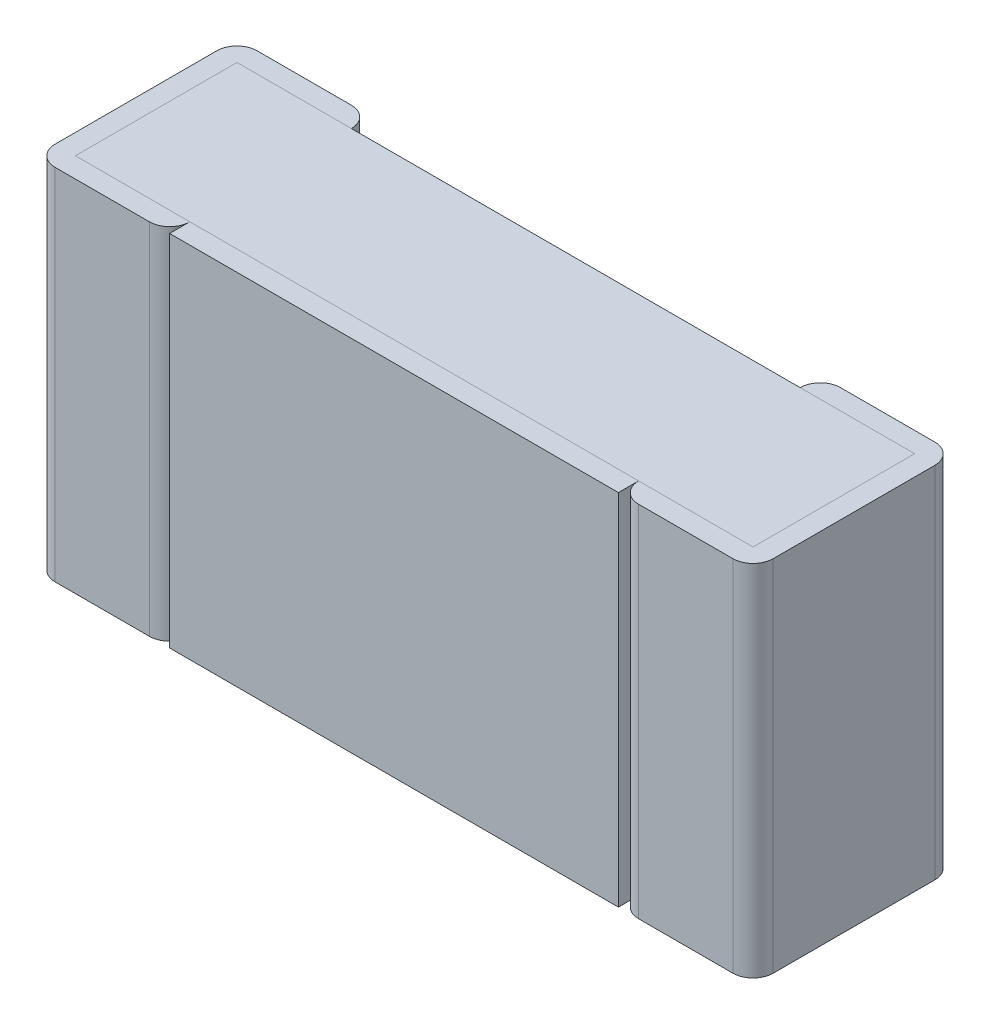
ISO-10303-21;
HEADER;
FILE_DESCRIPTION(('STEP AP214'),'2;1');
FILE_NAME('part.step','',(''),(''),'','','');
FILE_SCHEMA(('AUTOMOTIVE_DESIGN { 1 0 10303 214 1 1 1 1 }'));
ENDSEC;
DATA;
#1=APPLICATION_CONTEXT('core data for automotive mechanical design processes');
#2=APPLICATION_PROTOCOL_DEFINITION('international standard','automotive_design',2000,#1);
#3=PRODUCT_CONTEXT('',#1,'mechanical');
#4=PRODUCT('Part','Part','',(#3));
#5=PRODUCT_RELATED_PRODUCT_CATEGORY('part','',(#4));
#6=PRODUCT_DEFINITION_FORMATION('','',#4);
#7=PRODUCT_DEFINITION_CONTEXT('part definition',#1,'design');
#8=PRODUCT_DEFINITION('design','',#6,#7);
#9=PRODUCT_DEFINITION_SHAPE('','',#8);
#10=(LENGTH_UNIT() NAMED_UNIT(*) SI_UNIT(.MILLI.,.METRE.));
#11=(NAMED_UNIT(*) PLANE_ANGLE_UNIT() SI_UNIT($,.RADIAN.));
#12=(NAMED_UNIT(*) SI_UNIT($,.STERADIAN.) SOLID_ANGLE_UNIT());
#13=UNCERTAINTY_MEASURE_WITH_UNIT(LENGTH_MEASURE(1.E-05),#10,'distance_accuracy_value','');
#14=(GEOMETRIC_REPRESENTATION_CONTEXT(3) GLOBAL_UNCERTAINTY_ASSIGNED_CONTEXT((#13)) GLOBAL_UNIT_ASSIGNED_CONTEXT((#10,
#11,#12)) REPRESENTATION_CONTEXT('',''));
#15=CARTESIAN_POINT('',(0.,0.,0.));
#16=DIRECTION('',(0.,0.,1.));
#17=DIRECTION('',(1.,0.,0.));
#18=AXIS2_PLACEMENT_3D('',#15,#16,#17);
#19=CARTESIAN_POINT('',(133.066744279938,114.88604329235,112.661582908599));
#20=DIRECTION('',(0.,0.,1.));
#21=DIRECTION('',(1.,0.,0.));
#22=AXIS2_PLACEMENT_3D('',#19,#20,#21);
#23=PLANE('',#22);
#24=DIRECTION('',(0.,-1.,0.));
#25=VECTOR('',#24,1.);
#26=CARTESIAN_POINT('',(133.066744279938,114.88604329235,112.661582908599));
#27=LINE('',#26,#25);
#28=CARTESIAN_POINT('',(133.066744279938,114.88604329235,112.661582908599));
#29=VERTEX_POINT('',#28);
#30=CARTESIAN_POINT('',(133.066744279938,114.08604329235,112.661582908599));
#31=VERTEX_POINT('',#30);
#32=EDGE_CURVE('E67',#29,#31,#27,.T.);
#33=ORIENTED_EDGE('',*,*,#32,.F.);
#34=DIRECTION('',(-1.,0.,0.));
#35=VECTOR('',#34,1.);
#36=CARTESIAN_POINT('',(133.066744279938,114.88604329235,112.661582908599));
#37=LINE('',#36,#35);
#38=CARTESIAN_POINT('',(132.066744279938,114.88604329235,112.661582908599));
#39=VERTEX_POINT('',#38);
#40=EDGE_CURVE('E11',#29,#39,#37,.T.);
#41=ORIENTED_EDGE('',*,*,#40,.T.);
#42=DIRECTION('',(0.,-1.,0.));
#43=VECTOR('',#42,1.);
#44=CARTESIAN_POINT('',(132.066744279938,114.88604329235,112.661582908599));
#45=LINE('',#44,#43);
#46=CARTESIAN_POINT('',(132.066744279938,114.08604329235,112.661582908599));
#47=VERTEX_POINT('',#46);
#48=EDGE_CURVE('E55',#39,#47,#45,.T.);
#49=ORIENTED_EDGE('',*,*,#48,.T.);
#50=DIRECTION('',(-1.,0.,0.));
#51=VECTOR('',#50,1.);
#52=CARTESIAN_POINT('',(133.066744279938,114.08604329235,112.661582908599));
#53=LINE('',#52,#51);
#54=EDGE_CURVE('E384',#31,#47,#53,.T.);
#55=ORIENTED_EDGE('',*,*,#54,.F.);
#56=EDGE_LOOP('',(#33,#41,#49,#55));
#57=FACE_BOUND('',#56,.T.);
#58=ADVANCED_FACE('F44',(#57),#23,.T.);
#59=CARTESIAN_POINT('',(132.066744279938,114.88604329235,112.616582908599));
#60=DIRECTION('',(-1.,0.,0.));
#61=DIRECTION('',(0.,0.,1.));
#62=AXIS2_PLACEMENT_3D('',#59,#60,#61);
#63=PLANE('',#62);
#64=DIRECTION('',(0.,0.,1.));
#65=VECTOR('',#64,1.);
#66=CARTESIAN_POINT('',(132.066744279938,114.88604329235,112.616582908599));
#67=LINE('',#66,#65);
#68=CARTESIAN_POINT('',(132.066744279938,114.88604329235,112.616582908599));
#69=VERTEX_POINT('',#68);
#70=EDGE_CURVE('E287',#69,#39,#67,.T.);
#71=ORIENTED_EDGE('',*,*,#70,.F.);
#72=DIRECTION('',(0.,-1.,0.));
#73=VECTOR('',#72,1.);
#74=CARTESIAN_POINT('',(132.066744279938,114.88604329235,112.616582908599));
#75=LINE('',#74,#73);
#76=CARTESIAN_POINT('',(132.066744279938,114.08604329235,112.616582908599));
#77=VERTEX_POINT('',#76);
#78=EDGE_CURVE('E345',#69,#77,#75,.T.);
#79=ORIENTED_EDGE('',*,*,#78,.T.);
#80=DIRECTION('',(0.,0.,1.));
#81=VECTOR('',#80,1.);
#82=CARTESIAN_POINT('',(132.066744279938,114.08604329235,112.616582908599));
#83=LINE('',#82,#81);
#84=EDGE_CURVE('E454',#77,#47,#83,.T.);
#85=ORIENTED_EDGE('',*,*,#84,.T.);
#86=ORIENTED_EDGE('',*,*,#48,.F.);
#87=EDGE_LOOP('',(#71,#79,#85,#86));
#88=FACE_BOUND('',#87,.T.);
#89=ADVANCED_FACE('F581',(#88),#63,.T.);
#90=CARTESIAN_POINT('',(132.021744279938,114.88604329235,112.616582908599));
#91=DIRECTION('',(0.,-1.,0.));
#92=DIRECTION('',(1.,0.,0.));
#93=AXIS2_PLACEMENT_3D('',#90,#91,#92);
#94=CYLINDRICAL_SURFACE('',#93,0.0449999999999895);
#95=CARTESIAN_POINT('',(132.021744279938,114.88604329235,112.616582908599));
#96=DIRECTION('',(0.,-1.,0.));
#97=DIRECTION('',(0.,0.,1.));
#98=AXIS2_PLACEMENT_3D('',#95,#96,#97);
#99=CIRCLE('',#98,0.0450000000000034);
#100=CARTESIAN_POINT('',(132.021744279938,114.88604329235,112.661582908599));
#101=VERTEX_POINT('',#100);
#102=EDGE_CURVE('E312',#69,#101,#99,.T.);
#103=ORIENTED_EDGE('',*,*,#102,.T.);
#104=DIRECTION('',(0.,-1.,0.));
#105=VECTOR('',#104,1.);
#106=CARTESIAN_POINT('',(132.021744279938,114.88604329235,112.661582908599));
#107=LINE('',#106,#105);
#108=CARTESIAN_POINT('',(132.021744279938,114.08604329235,112.661582908599));
#109=VERTEX_POINT('',#108);
#110=EDGE_CURVE('E308',#101,#109,#107,.T.);
#111=ORIENTED_EDGE('',*,*,#110,.T.);
#112=CARTESIAN_POINT('',(132.021744279938,114.08604329235,112.616582908599));
#113=DIRECTION('',(0.,-1.,0.));
#114=DIRECTION('',(0.,0.,1.));
#115=AXIS2_PLACEMENT_3D('',#112,#113,#114);
#116=CIRCLE('',#115,0.0450000000000034);
#117=EDGE_CURVE('E306',#77,#109,#116,.T.);
#118=ORIENTED_EDGE('',*,*,#117,.F.);
#119=ORIENTED_EDGE('',*,*,#78,.F.);
#120=EDGE_LOOP('',(#103,#111,#118,#119));
#121=FACE_BOUND('',#120,.T.);
#122=ADVANCED_FACE('F566',(#121),#94,.T.);
#123=CARTESIAN_POINT('',(132.066744279938,114.88604329235,112.661582908599));
#124=DIRECTION('',(0.,0.,1.));
#125=DIRECTION('',(1.,0.,0.));
#126=AXIS2_PLACEMENT_3D('',#123,#124,#125);
#127=PLANE('',#126);
#128=DIRECTION('',(-1.,0.,0.));
#129=VECTOR('',#128,1.);
#130=CARTESIAN_POINT('',(132.066744279938,114.08604329235,112.661582908599));
#131=LINE('',#130,#129);
#132=CARTESIAN_POINT('',(131.811744279938,114.08604329235,112.661582908599));
#133=VERTEX_POINT('',#132);
#134=EDGE_CURVE('E303',#109,#133,#131,.T.);
#135=ORIENTED_EDGE('',*,*,#134,.F.);
#136=ORIENTED_EDGE('',*,*,#110,.F.);
#137=DIRECTION('',(-1.,0.,0.));
#138=VECTOR('',#137,1.);
#139=CARTESIAN_POINT('',(132.066744279938,114.88604329235,112.661582908599));
#140=LINE('',#139,#138);
#141=CARTESIAN_POINT('',(131.811744279938,114.88604329235,112.661582908599));
#142=VERTEX_POINT('',#141);
#143=EDGE_CURVE('E313',#101,#142,#140,.T.);
#144=ORIENTED_EDGE('',*,*,#143,.T.);
#145=DIRECTION('',(0.,-1.,0.));
#146=VECTOR('',#145,1.);
#147=CARTESIAN_POINT('',(131.811744279938,114.88604329235,112.661582908599));
#148=LINE('',#147,#146);
#149=EDGE_CURVE('E371',#142,#133,#148,.T.);
#150=ORIENTED_EDGE('',*,*,#149,.T.);
#151=EDGE_LOOP('',(#135,#136,#144,#150));
#152=FACE_BOUND('',#151,.T.);
#153=ADVANCED_FACE('F561',(#152),#127,.T.);
#154=CARTESIAN_POINT('',(131.811744279938,114.88604329235,112.616582908599));
#155=DIRECTION('',(0.,-1.,0.));
#156=DIRECTION('',(-1.,0.,0.));
#157=AXIS2_PLACEMENT_3D('',#154,#155,#156);
#158=CYLINDRICAL_SURFACE('',#157,0.0449999999999895);
#159=DIRECTION('',(0.,-1.,0.));
#160=VECTOR('',#159,1.);
#161=CARTESIAN_POINT('',(131.766744279938,114.88604329235,112.616582908599));
#162=LINE('',#161,#160);
#163=CARTESIAN_POINT('',(131.766744279938,114.88604329235,112.616582908599));
#164=VERTEX_POINT('',#163);
#165=CARTESIAN_POINT('',(131.766744279938,114.08604329235,112.616582908599));
#166=VERTEX_POINT('',#165);
#167=EDGE_CURVE('E372',#164,#166,#162,.T.);
#168=ORIENTED_EDGE('',*,*,#167,.T.);
#169=CARTESIAN_POINT('',(131.811744279938,114.08604329235,112.616582908599));
#170=DIRECTION('',(0.,1.,0.));
#171=DIRECTION('',(0.,0.,1.));
#172=AXIS2_PLACEMENT_3D('',#169,#170,#171);
#173=CIRCLE('',#172,0.0450000000000034);
#174=EDGE_CURVE('E376',#166,#133,#173,.T.);
#175=ORIENTED_EDGE('',*,*,#174,.T.);
#176=ORIENTED_EDGE('',*,*,#149,.F.);
#177=CARTESIAN_POINT('',(131.811744279938,114.88604329235,112.616582908599));
#178=DIRECTION('',(0.,1.,0.));
#179=DIRECTION('',(0.,0.,1.));
#180=AXIS2_PLACEMENT_3D('',#177,#178,#179);
#181=CIRCLE('',#180,0.0450000000000034);
#182=EDGE_CURVE('E328',#164,#142,#181,.T.);
#183=ORIENTED_EDGE('',*,*,#182,.F.);
#184=EDGE_LOOP('',(#168,#175,#176,#183));
#185=FACE_BOUND('',#184,.T.);
#186=ADVANCED_FACE('F558',(#185),#158,.T.);
#187=CARTESIAN_POINT('',(131.766744279938,114.88604329235,112.211582908599));
#188=DIRECTION('',(-1.,0.,0.));
#189=DIRECTION('',(0.,0.,1.));
#190=AXIS2_PLACEMENT_3D('',#187,#188,#189);
#191=PLANE('',#190);
#192=DIRECTION('',(0.,0.,1.));
#193=VECTOR('',#192,1.);
#194=CARTESIAN_POINT('',(131.766744279938,114.88604329235,112.211582908599));
#195=LINE('',#194,#193);
#196=CARTESIAN_POINT('',(131.766744279938,114.88604329235,112.256582908599));
#197=VERTEX_POINT('',#196);
#198=EDGE_CURVE('E288',#197,#164,#195,.T.);
#199=ORIENTED_EDGE('',*,*,#198,.F.);
#200=DIRECTION('',(0.,-1.,0.));
#201=VECTOR('',#200,1.);
#202=CARTESIAN_POINT('',(131.766744279938,114.88604329235,112.256582908599));
#203=LINE('',#202,#201);
#204=CARTESIAN_POINT('',(131.766744279938,114.08604329235,112.256582908599));
#205=VERTEX_POINT('',#204);
#206=EDGE_CURVE('E349',#197,#205,#203,.T.);
#207=ORIENTED_EDGE('',*,*,#206,.T.);
#208=DIRECTION('',(0.,0.,1.));
#209=VECTOR('',#208,1.);
#210=CARTESIAN_POINT('',(131.766744279938,114.08604329235,112.211582908599));
#211=LINE('',#210,#209);
#212=EDGE_CURVE('E346',#205,#166,#211,.T.);
#213=ORIENTED_EDGE('',*,*,#212,.T.);
#214=ORIENTED_EDGE('',*,*,#167,.F.);
#215=EDGE_LOOP('',(#199,#207,#213,#214));
#216=FACE_BOUND('',#215,.T.);
#217=ADVANCED_FACE('F556',(#216),#191,.T.);
#218=CARTESIAN_POINT('',(131.811744279938,114.88604329235,112.256582908599));
#219=DIRECTION('',(0.,-1.,0.));
#220=DIRECTION('',(-1.,0.,0.));
#221=AXIS2_PLACEMENT_3D('',#218,#219,#220);
#222=CYLINDRICAL_SURFACE('',#221,0.0449999999999895);
#223=CARTESIAN_POINT('',(131.811744279938,114.88604329235,112.256582908599));
#224=DIRECTION('',(0.,-1.,0.));
#225=DIRECTION('',(0.,0.,1.));
#226=AXIS2_PLACEMENT_3D('',#223,#224,#225);
#227=CIRCLE('',#226,0.0450000000000034);
#228=CARTESIAN_POINT('',(131.811744279938,114.88604329235,112.211582908599));
#229=VERTEX_POINT('',#228);
#230=EDGE_CURVE('E350',#197,#229,#227,.T.);
#231=ORIENTED_EDGE('',*,*,#230,.T.);
#232=DIRECTION('',(0.,-1.,0.));
#233=VECTOR('',#232,1.);
#234=CARTESIAN_POINT('',(131.811744279938,114.88604329235,112.211582908599));
#235=LINE('',#234,#233);
#236=CARTESIAN_POINT('',(131.811744279938,114.08604329235,112.211582908599));
#237=VERTEX_POINT('',#236);
#238=EDGE_CURVE('E338',#229,#237,#235,.T.);
#239=ORIENTED_EDGE('',*,*,#238,.T.);
#240=CARTESIAN_POINT('',(131.811744279938,114.08604329235,112.256582908599));
#241=DIRECTION('',(0.,-1.,0.));
#242=DIRECTION('',(0.,0.,1.));
#243=AXIS2_PLACEMENT_3D('',#240,#241,#242);
#244=CIRCLE('',#243,0.0450000000000034);
#245=EDGE_CURVE('E307',#205,#237,#244,.T.);
#246=ORIENTED_EDGE('',*,*,#245,.F.);
#247=ORIENTED_EDGE('',*,*,#206,.F.);
#248=EDGE_LOOP('',(#231,#239,#246,#247));
#249=FACE_BOUND('',#248,.T.);
#250=ADVANCED_FACE('F552',(#249),#222,.T.);
#251=CARTESIAN_POINT('',(132.066744279938,114.88604329235,112.211582908599));
#252=DIRECTION('',(0.,0.,1.));
#253=DIRECTION('',(1.,0.,0.));
#254=AXIS2_PLACEMENT_3D('',#251,#252,#253);
#255=PLANE('',#254);
#256=ORIENTED_EDGE('',*,*,#238,.F.);
#257=DIRECTION('',(-1.,0.,0.));
#258=VECTOR('',#257,1.);
#259=CARTESIAN_POINT('',(132.066744279938,114.88604329235,112.211582908599));
#260=LINE('',#259,#258);
#261=CARTESIAN_POINT('',(132.021744279938,114.88604329235,112.211582908599));
#262=VERTEX_POINT('',#261);
#263=EDGE_CURVE('E359',#262,#229,#260,.T.);
#264=ORIENTED_EDGE('',*,*,#263,.F.);
#265=DIRECTION('',(0.,-1.,0.));
#266=VECTOR('',#265,1.);
#267=CARTESIAN_POINT('',(132.021744279938,114.88604329235,112.211582908599));
#268=LINE('',#267,#266);
#269=CARTESIAN_POINT('',(132.021744279938,114.08604329235,112.211582908599));
#270=VERTEX_POINT('',#269);
#271=EDGE_CURVE('E334',#262,#270,#268,.T.);
#272=ORIENTED_EDGE('',*,*,#271,.T.);
#273=DIRECTION('',(-1.,0.,0.));
#274=VECTOR('',#273,1.);
#275=CARTESIAN_POINT('',(132.066744279938,114.08604329235,112.211582908599));
#276=LINE('',#275,#274);
#277=EDGE_CURVE('E301',#270,#237,#276,.T.);
#278=ORIENTED_EDGE('',*,*,#277,.T.);
#279=EDGE_LOOP('',(#256,#264,#272,#278));
#280=FACE_BOUND('',#279,.T.);
#281=ADVANCED_FACE('F540',(#280),#255,.F.);
#282=CARTESIAN_POINT('',(132.021744279938,114.88604329235,112.256582908599));
#283=DIRECTION('',(0.,-1.,0.));
#284=DIRECTION('',(1.,0.,0.));
#285=AXIS2_PLACEMENT_3D('',#282,#283,#284);
#286=CYLINDRICAL_SURFACE('',#285,0.0449999999999895);
#287=DIRECTION('',(0.,-1.,0.));
#288=VECTOR('',#287,1.);
#289=CARTESIAN_POINT('',(132.066744279938,114.88604329235,112.256582908599));
#290=LINE('',#289,#288);
#291=CARTESIAN_POINT('',(132.066744279938,114.88604329235,112.256582908599));
#292=VERTEX_POINT('',#291);
#293=CARTESIAN_POINT('',(132.066744279938,114.08604329235,112.256582908599));
#294=VERTEX_POINT('',#293);
#295=EDGE_CURVE('E297',#292,#294,#290,.T.);
#296=ORIENTED_EDGE('',*,*,#295,.T.);
#297=CARTESIAN_POINT('',(132.021744279938,114.08604329235,112.256582908599));
#298=DIRECTION('',(0.,1.,0.));
#299=DIRECTION('',(0.,0.,1.));
#300=AXIS2_PLACEMENT_3D('',#297,#298,#299);
#301=CIRCLE('',#300,0.0450000000000034);
#302=EDGE_CURVE('E302',#294,#270,#301,.T.);
#303=ORIENTED_EDGE('',*,*,#302,.T.);
#304=ORIENTED_EDGE('',*,*,#271,.F.);
#305=CARTESIAN_POINT('',(132.021744279938,114.88604329235,112.256582908599));
#306=DIRECTION('',(0.,1.,0.));
#307=DIRECTION('',(0.,0.,1.));
#308=AXIS2_PLACEMENT_3D('',#305,#306,#307);
#309=CIRCLE('',#308,0.0450000000000034);
#310=EDGE_CURVE('E329',#292,#262,#309,.T.);
#311=ORIENTED_EDGE('',*,*,#310,.F.);
#312=EDGE_LOOP('',(#296,#303,#304,#311));
#313=FACE_BOUND('',#312,.T.);
#314=ADVANCED_FACE('F537',(#313),#286,.T.);
#315=CARTESIAN_POINT('',(133.066744279938,114.08604329235,112.616582908599));
#316=DIRECTION('',(0.,-1.,0.));
#317=DIRECTION('',(0.,0.,-1.));
#318=AXIS2_PLACEMENT_3D('',#315,#316,#317);
#319=PLANE('',#318);
#320=DIRECTION('',(-1.,0.,0.));
#321=VECTOR('',#320,1.);
#322=CARTESIAN_POINT('',(133.066744279938,114.08604329235,112.616582908599));
#323=LINE('',#322,#321);
#324=CARTESIAN_POINT('',(133.066744279938,114.08604329235,112.616582908599));
#325=VERTEX_POINT('',#324);
#326=EDGE_CURVE('E445',#325,#77,#323,.T.);
#327=ORIENTED_EDGE('',*,*,#326,.F.);
#328=DIRECTION('',(0.,0.,1.));
#329=VECTOR('',#328,1.);
#330=CARTESIAN_POINT('',(133.066744279938,114.08604329235,112.616582908599));
#331=LINE('',#330,#329);
#332=EDGE_CURVE('E380',#325,#31,#331,.T.);
#333=ORIENTED_EDGE('',*,*,#332,.T.);
#334=ORIENTED_EDGE('',*,*,#54,.T.);
#335=ORIENTED_EDGE('',*,*,#84,.F.);
#336=EDGE_LOOP('',(#327,#333,#334,#335));
#337=FACE_BOUND('',#336,.T.);
#338=ADVANCED_FACE('F596',(#337),#319,.T.);
#339=CARTESIAN_POINT('',(132.066744279938,114.08604329235,112.211582908599));
#340=DIRECTION('',(0.,-1.,0.));
#341=DIRECTION('',(0.,0.,-1.));
#342=AXIS2_PLACEMENT_3D('',#339,#340,#341);
#343=PLANE('',#342);
#344=ORIENTED_EDGE('',*,*,#277,.F.);
#345=ORIENTED_EDGE('',*,*,#302,.F.);
#346=DIRECTION('',(-1.,0.,0.));
#347=VECTOR('',#346,1.);
#348=CARTESIAN_POINT('',(133.321744279938,114.08604329235,112.256582908599));
#349=LINE('',#348,#347);
#350=CARTESIAN_POINT('',(131.811744279938,114.08604329235,112.256582908599));
#351=VERTEX_POINT('',#350);
#352=EDGE_CURVE('E381',#294,#351,#349,.T.);
#353=ORIENTED_EDGE('',*,*,#352,.T.);
#354=DIRECTION('',(0.,0.,1.));
#355=VECTOR('',#354,1.);
#356=CARTESIAN_POINT('',(131.811744279938,114.08604329235,112.256582908599));
#357=LINE('',#356,#355);
#358=CARTESIAN_POINT('',(131.811744279938,114.08604329235,112.616582908599));
#359=VERTEX_POINT('',#358);
#360=EDGE_CURVE('E385',#351,#359,#357,.T.);
#361=ORIENTED_EDGE('',*,*,#360,.T.);
#362=DIRECTION('',(-1.,0.,0.));
#363=VECTOR('',#362,1.);
#364=CARTESIAN_POINT('',(133.321744279938,114.08604329235,112.616582908599));
#365=LINE('',#364,#363);
#366=EDGE_CURVE('E444',#77,#359,#365,.T.);
#367=ORIENTED_EDGE('',*,*,#366,.F.);
#368=ORIENTED_EDGE('',*,*,#117,.T.);
#369=ORIENTED_EDGE('',*,*,#134,.T.);
#370=ORIENTED_EDGE('',*,*,#174,.F.);
#371=ORIENTED_EDGE('',*,*,#212,.F.);
#372=ORIENTED_EDGE('',*,*,#245,.T.);
#373=EDGE_LOOP('',(#344,#345,#353,#361,#367,#368,#369,#370,#371,#372));
#374=FACE_BOUND('',#373,.T.);
#375=ADVANCED_FACE('F545',(#374),#343,.T.);
#376=CARTESIAN_POINT('',(133.066744279938,114.88604329235,112.616582908599));
#377=DIRECTION('',(-1.,0.,0.));
#378=DIRECTION('',(0.,0.,1.));
#379=AXIS2_PLACEMENT_3D('',#376,#377,#378);
#380=PLANE('',#379);
#381=ORIENTED_EDGE('',*,*,#32,.T.);
#382=ORIENTED_EDGE('',*,*,#332,.F.);
#383=DIRECTION('',(0.,-1.,0.));
#384=VECTOR('',#383,1.);
#385=CARTESIAN_POINT('',(133.066744279938,114.88604329235,112.616582908599));
#386=LINE('',#385,#384);
#387=CARTESIAN_POINT('',(133.066744279938,114.88604329235,112.616582908599));
#388=VERTEX_POINT('',#387);
#389=EDGE_CURVE('E293',#388,#325,#386,.T.);
#390=ORIENTED_EDGE('',*,*,#389,.F.);
#391=DIRECTION('',(0.,0.,1.));
#392=VECTOR('',#391,1.);
#393=CARTESIAN_POINT('',(133.066744279938,114.88604329235,112.616582908599));
#394=LINE('',#393,#392);
#395=EDGE_CURVE('E341',#388,#29,#394,.T.);
#396=ORIENTED_EDGE('',*,*,#395,.T.);
#397=EDGE_LOOP('',(#381,#382,#390,#396));
#398=FACE_BOUND('',#397,.T.);
#399=ADVANCED_FACE('F580',(#398),#380,.F.);
#400=CARTESIAN_POINT('',(133.066744279938,114.88604329235,112.616582908599));
#401=DIRECTION('',(0.,-1.,0.));
#402=DIRECTION('',(0.,0.,-1.));
#403=AXIS2_PLACEMENT_3D('',#400,#401,#402);
#404=PLANE('',#403);
#405=ORIENTED_EDGE('',*,*,#70,.T.);
#406=ORIENTED_EDGE('',*,*,#40,.F.);
#407=ORIENTED_EDGE('',*,*,#395,.F.);
#408=DIRECTION('',(-1.,0.,0.));
#409=VECTOR('',#408,1.);
#410=CARTESIAN_POINT('',(133.066744279938,114.88604329235,112.616582908599));
#411=LINE('',#410,#409);
#412=EDGE_CURVE('E284',#388,#69,#411,.T.);
#413=ORIENTED_EDGE('',*,*,#412,.T.);
#414=EDGE_LOOP('',(#405,#406,#407,#413));
#415=FACE_BOUND('',#414,.T.);
#416=ADVANCED_FACE('F569',(#415),#404,.F.);
#417=CARTESIAN_POINT('',(132.066744279938,114.88604329235,112.211582908599));
#418=DIRECTION('',(0.,-1.,0.));
#419=DIRECTION('',(0.,0.,-1.));
#420=AXIS2_PLACEMENT_3D('',#417,#418,#419);
#421=PLANE('',#420);
#422=ORIENTED_EDGE('',*,*,#230,.F.);
#423=ORIENTED_EDGE('',*,*,#198,.T.);
#424=ORIENTED_EDGE('',*,*,#182,.T.);
#425=ORIENTED_EDGE('',*,*,#143,.F.);
#426=ORIENTED_EDGE('',*,*,#102,.F.);
#427=DIRECTION('',(-1.,0.,0.));
#428=VECTOR('',#427,1.);
#429=CARTESIAN_POINT('',(133.321744279938,114.88604329235,112.616582908599));
#430=LINE('',#429,#428);
#431=CARTESIAN_POINT('',(131.811744279938,114.88604329235,112.616582908599));
#432=VERTEX_POINT('',#431);
#433=EDGE_CURVE('E325',#69,#432,#430,.T.);
#434=ORIENTED_EDGE('',*,*,#433,.T.);
#435=DIRECTION('',(0.,0.,1.));
#436=VECTOR('',#435,1.);
#437=CARTESIAN_POINT('',(131.811744279938,114.88604329235,112.256582908599));
#438=LINE('',#437,#436);
#439=CARTESIAN_POINT('',(131.811744279938,114.88604329235,112.256582908599));
#440=VERTEX_POINT('',#439);
#441=EDGE_CURVE('E323',#440,#432,#438,.T.);
#442=ORIENTED_EDGE('',*,*,#441,.F.);
#443=DIRECTION('',(-1.,0.,0.));
#444=VECTOR('',#443,1.);
#445=CARTESIAN_POINT('',(133.321744279938,114.88604329235,112.256582908599));
#446=LINE('',#445,#444);
#447=EDGE_CURVE('E367',#292,#440,#446,.T.);
#448=ORIENTED_EDGE('',*,*,#447,.F.);
#449=ORIENTED_EDGE('',*,*,#310,.T.);
#450=ORIENTED_EDGE('',*,*,#263,.T.);
#451=EDGE_LOOP('',(#422,#423,#424,#425,#426,#434,#442,#448,#449,#450));
#452=FACE_BOUND('',#451,.T.);
#453=ADVANCED_FACE('F534',(#452),#421,.F.);
#454=CARTESIAN_POINT('',(133.321744279938,114.88604329235,112.256582908599));
#455=DIRECTION('',(0.,0.,1.));
#456=DIRECTION('',(1.,0.,0.));
#457=AXIS2_PLACEMENT_3D('',#454,#455,#456);
#458=PLANE('',#457);
#459=DIRECTION('',(-1.,0.,0.));
#460=VECTOR('',#459,1.);
#461=CARTESIAN_POINT('',(133.321744279938,114.08604329235,112.256582908599));
#462=LINE('',#461,#460);
#463=CARTESIAN_POINT('',(133.066744279938,114.08604329235,112.256582908599));
#464=VERTEX_POINT('',#463);
#465=EDGE_CURVE('E355',#464,#294,#462,.T.);
#466=ORIENTED_EDGE('',*,*,#465,.T.);
#467=ORIENTED_EDGE('',*,*,#295,.F.);
#468=DIRECTION('',(-1.,0.,0.));
#469=VECTOR('',#468,1.);
#470=CARTESIAN_POINT('',(133.321744279938,114.88604329235,112.256582908599));
#471=LINE('',#470,#469);
#472=CARTESIAN_POINT('',(133.066744279938,114.88604329235,112.256582908599));
#473=VERTEX_POINT('',#472);
#474=EDGE_CURVE('E422',#473,#292,#471,.T.);
#475=ORIENTED_EDGE('',*,*,#474,.F.);
#476=DIRECTION('',(0.,-1.,0.));
#477=VECTOR('',#476,1.);
#478=CARTESIAN_POINT('',(133.066744279938,114.88604329235,112.256582908599));
#479=LINE('',#478,#477);
#480=EDGE_CURVE('E360',#473,#464,#479,.T.);
#481=ORIENTED_EDGE('',*,*,#480,.T.);
#482=EDGE_LOOP('',(#466,#467,#475,#481));
#483=FACE_BOUND('',#482,.T.);
#484=ADVANCED_FACE('F514',(#483),#458,.F.);
#485=CARTESIAN_POINT('',(133.321744279938,114.08604329235,112.256582908599));
#486=DIRECTION('',(0.,-1.,0.));
#487=DIRECTION('',(0.,0.,-1.));
#488=AXIS2_PLACEMENT_3D('',#485,#486,#487);
#489=PLANE('',#488);
#490=DIRECTION('',(-1.,0.,0.));
#491=VECTOR('',#490,1.);
#492=CARTESIAN_POINT('',(133.321744279938,114.08604329235,112.256582908599));
#493=LINE('',#492,#491);
#494=CARTESIAN_POINT('',(133.321744279938,114.08604329235,112.256582908599));
#495=VERTEX_POINT('',#494);
#496=EDGE_CURVE('E280',#495,#464,#493,.T.);
#497=ORIENTED_EDGE('',*,*,#496,.F.);
#498=DIRECTION('',(0.,0.,1.));
#499=VECTOR('',#498,1.);
#500=CARTESIAN_POINT('',(133.321744279938,114.08604329235,112.256582908599));
#501=LINE('',#500,#499);
#502=CARTESIAN_POINT('',(133.321744279938,114.08604329235,112.616582908599));
#503=VERTEX_POINT('',#502);
#504=EDGE_CURVE('E396',#495,#503,#501,.T.);
#505=ORIENTED_EDGE('',*,*,#504,.T.);
#506=DIRECTION('',(-1.,0.,0.));
#507=VECTOR('',#506,1.);
#508=CARTESIAN_POINT('',(133.321744279938,114.08604329235,112.616582908599));
#509=LINE('',#508,#507);
#510=EDGE_CURVE('E428',#503,#325,#509,.T.);
#511=ORIENTED_EDGE('',*,*,#510,.T.);
#512=ORIENTED_EDGE('',*,*,#326,.T.);
#513=ORIENTED_EDGE('',*,*,#366,.T.);
#514=ORIENTED_EDGE('',*,*,#360,.F.);
#515=ORIENTED_EDGE('',*,*,#352,.F.);
#516=ORIENTED_EDGE('',*,*,#465,.F.);
#517=EDGE_LOOP('',(#497,#505,#511,#512,#513,#514,#515,#516));
#518=FACE_BOUND('',#517,.T.);
#519=ADVANCED_FACE('F518',(#518),#489,.T.);
#520=CARTESIAN_POINT('',(133.111744279938,114.88604329235,112.616582908599));
#521=DIRECTION('',(0.,-1.,0.));
#522=DIRECTION('',(-1.,0.,0.));
#523=AXIS2_PLACEMENT_3D('',#520,#521,#522);
#524=CYLINDRICAL_SURFACE('',#523,0.0449999999999895);
#525=ORIENTED_EDGE('',*,*,#389,.T.);
#526=CARTESIAN_POINT('',(133.111744279938,114.08604329235,112.616582908599));
#527=DIRECTION('',(0.,1.,0.));
#528=DIRECTION('',(0.,0.,1.));
#529=AXIS2_PLACEMENT_3D('',#526,#527,#528);
#530=CIRCLE('',#529,0.0450000000000034);
#531=CARTESIAN_POINT('',(133.111744279938,114.08604329235,112.661582908599));
#532=VERTEX_POINT('',#531);
#533=EDGE_CURVE('E289',#325,#532,#530,.T.);
#534=ORIENTED_EDGE('',*,*,#533,.T.);
#535=DIRECTION('',(0.,-1.,0.));
#536=VECTOR('',#535,1.);
#537=CARTESIAN_POINT('',(133.111744279938,114.88604329235,112.661582908599));
#538=LINE('',#537,#536);
#539=CARTESIAN_POINT('',(133.111744279938,114.88604329235,112.661582908599));
#540=VERTEX_POINT('',#539);
#541=EDGE_CURVE('E296',#540,#532,#538,.T.);
#542=ORIENTED_EDGE('',*,*,#541,.F.);
#543=CARTESIAN_POINT('',(133.111744279938,114.88604329235,112.616582908599));
#544=DIRECTION('',(0.,1.,0.));
#545=DIRECTION('',(0.,0.,1.));
#546=AXIS2_PLACEMENT_3D('',#543,#544,#545);
#547=CIRCLE('',#546,0.0450000000000034);
#548=EDGE_CURVE('E437',#388,#540,#547,.T.);
#549=ORIENTED_EDGE('',*,*,#548,.F.);
#550=EDGE_LOOP('',(#525,#534,#542,#549));
#551=FACE_BOUND('',#550,.T.);
#552=ADVANCED_FACE('F575',(#551),#524,.T.);
#553=CARTESIAN_POINT('',(133.366744279938,114.88604329235,112.661582908599));
#554=DIRECTION('',(0.,0.,1.));
#555=DIRECTION('',(1.,0.,0.));
#556=AXIS2_PLACEMENT_3D('',#553,#554,#555);
#557=PLANE('',#556);
#558=DIRECTION('',(-1.,0.,0.));
#559=VECTOR('',#558,1.);
#560=CARTESIAN_POINT('',(133.366744279938,114.08604329235,112.661582908599));
#561=LINE('',#560,#559);
#562=CARTESIAN_POINT('',(133.321744279938,114.08604329235,112.661582908599));
#563=VERTEX_POINT('',#562);
#564=EDGE_CURVE('E277',#563,#532,#561,.T.);
#565=ORIENTED_EDGE('',*,*,#564,.F.);
#566=DIRECTION('',(0.,-1.,0.));
#567=VECTOR('',#566,1.);
#568=CARTESIAN_POINT('',(133.321744279938,114.88604329235,112.661582908599));
#569=LINE('',#568,#567);
#570=CARTESIAN_POINT('',(133.321744279938,114.88604329235,112.661582908599));
#571=VERTEX_POINT('',#570);
#572=EDGE_CURVE('E264',#571,#563,#569,.T.);
#573=ORIENTED_EDGE('',*,*,#572,.F.);
#574=DIRECTION('',(-1.,0.,0.));
#575=VECTOR('',#574,1.);
#576=CARTESIAN_POINT('',(133.366744279938,114.88604329235,112.661582908599));
#577=LINE('',#576,#575);
#578=EDGE_CURVE('E261',#571,#540,#577,.T.);
#579=ORIENTED_EDGE('',*,*,#578,.T.);
#580=ORIENTED_EDGE('',*,*,#541,.T.);
#581=EDGE_LOOP('',(#565,#573,#579,#580));
#582=FACE_BOUND('',#581,.T.);
#583=ADVANCED_FACE('F579',(#582),#557,.T.);
#584=CARTESIAN_POINT('',(133.321744279938,114.88604329235,112.256582908599));
#585=DIRECTION('',(0.,-1.,0.));
#586=DIRECTION('',(0.,0.,-1.));
#587=AXIS2_PLACEMENT_3D('',#584,#585,#586);
#588=PLANE('',#587);
#589=ORIENTED_EDGE('',*,*,#474,.T.);
#590=ORIENTED_EDGE('',*,*,#447,.T.);
#591=ORIENTED_EDGE('',*,*,#441,.T.);
#592=ORIENTED_EDGE('',*,*,#433,.F.);
#593=ORIENTED_EDGE('',*,*,#412,.F.);
#594=DIRECTION('',(-1.,0.,0.));
#595=VECTOR('',#594,1.);
#596=CARTESIAN_POINT('',(133.321744279938,114.88604329235,112.616582908599));
#597=LINE('',#596,#595);
#598=CARTESIAN_POINT('',(133.321744279938,114.88604329235,112.616582908599));
#599=VERTEX_POINT('',#598);
#600=EDGE_CURVE('E119',#599,#388,#597,.T.);
#601=ORIENTED_EDGE('',*,*,#600,.F.);
#602=DIRECTION('',(0.,0.,1.));
#603=VECTOR('',#602,1.);
#604=CARTESIAN_POINT('',(133.321744279938,114.88604329235,112.256582908599));
#605=LINE('',#604,#603);
#606=CARTESIAN_POINT('',(133.321744279938,114.88604329235,112.256582908599));
#607=VERTEX_POINT('',#606);
#608=EDGE_CURVE('E131',#607,#599,#605,.T.);
#609=ORIENTED_EDGE('',*,*,#608,.F.);
#610=DIRECTION('',(-1.,0.,0.));
#611=VECTOR('',#610,1.);
#612=CARTESIAN_POINT('',(133.321744279938,114.88604329235,112.256582908599));
#613=LINE('',#612,#611);
#614=EDGE_CURVE('E320',#607,#473,#613,.T.);
#615=ORIENTED_EDGE('',*,*,#614,.T.);
#616=EDGE_LOOP('',(#589,#590,#591,#592,#593,#601,#609,#615));
#617=FACE_BOUND('',#616,.T.);
#618=ADVANCED_FACE('F527',(#617),#588,.F.);
#619=CARTESIAN_POINT('',(133.111744279938,114.88604329235,112.256582908599));
#620=DIRECTION('',(0.,-1.,0.));
#621=DIRECTION('',(-1.,0.,0.));
#622=AXIS2_PLACEMENT_3D('',#619,#620,#621);
#623=CYLINDRICAL_SURFACE('',#622,0.0449999999999895);
#624=CARTESIAN_POINT('',(133.111744279938,114.88604329235,112.256582908599));
#625=DIRECTION('',(0.,-1.,0.));
#626=DIRECTION('',(0.,0.,1.));
#627=AXIS2_PLACEMENT_3D('',#624,#625,#626);
#628=CIRCLE('',#627,0.0450000000000034);
#629=CARTESIAN_POINT('',(133.111744279938,114.88604329235,112.211582908599));
#630=VERTEX_POINT('',#629);
#631=EDGE_CURVE('E324',#473,#630,#628,.T.);
#632=ORIENTED_EDGE('',*,*,#631,.T.);
#633=DIRECTION('',(0.,-1.,0.));
#634=VECTOR('',#633,1.);
#635=CARTESIAN_POINT('',(133.111744279938,114.88604329235,112.211582908599));
#636=LINE('',#635,#634);
#637=CARTESIAN_POINT('',(133.111744279938,114.08604329235,112.211582908599));
#638=VERTEX_POINT('',#637);
#639=EDGE_CURVE('E333',#630,#638,#636,.T.);
#640=ORIENTED_EDGE('',*,*,#639,.T.);
#641=CARTESIAN_POINT('',(133.111744279938,114.08604329235,112.256582908599));
#642=DIRECTION('',(0.,-1.,0.));
#643=DIRECTION('',(0.,0.,1.));
#644=AXIS2_PLACEMENT_3D('',#641,#642,#643);
#645=CIRCLE('',#644,0.0450000000000034);
#646=EDGE_CURVE('E263',#464,#638,#645,.T.);
#647=ORIENTED_EDGE('',*,*,#646,.F.);
#648=ORIENTED_EDGE('',*,*,#480,.F.);
#649=EDGE_LOOP('',(#632,#640,#647,#648));
#650=FACE_BOUND('',#649,.T.);
#651=ADVANCED_FACE('F521',(#650),#623,.T.);
#652=CARTESIAN_POINT('',(133.366744279938,114.88604329235,112.211582908599));
#653=DIRECTION('',(0.,0.,1.));
#654=DIRECTION('',(1.,0.,0.));
#655=AXIS2_PLACEMENT_3D('',#652,#653,#654);
#656=PLANE('',#655);
#657=ORIENTED_EDGE('',*,*,#639,.F.);
#658=DIRECTION('',(-1.,0.,0.));
#659=VECTOR('',#658,1.);
#660=CARTESIAN_POINT('',(133.366744279938,114.88604329235,112.211582908599));
#661=LINE('',#660,#659);
#662=CARTESIAN_POINT('',(133.321744279938,114.88604329235,112.211582908599));
#663=VERTEX_POINT('',#662);
#664=EDGE_CURVE('E252',#663,#630,#661,.T.);
#665=ORIENTED_EDGE('',*,*,#664,.F.);
#666=DIRECTION('',(0.,-1.,0.));
#667=VECTOR('',#666,1.);
#668=CARTESIAN_POINT('',(133.321744279938,114.88604329235,112.211582908599));
#669=LINE('',#668,#667);
#670=CARTESIAN_POINT('',(133.321744279938,114.08604329235,112.211582908599));
#671=VERTEX_POINT('',#670);
#672=EDGE_CURVE('E318',#663,#671,#669,.T.);
#673=ORIENTED_EDGE('',*,*,#672,.T.);
#674=DIRECTION('',(-1.,0.,0.));
#675=VECTOR('',#674,1.);
#676=CARTESIAN_POINT('',(133.366744279938,114.08604329235,112.211582908599));
#677=LINE('',#676,#675);
#678=EDGE_CURVE('E314',#671,#638,#677,.T.);
#679=ORIENTED_EDGE('',*,*,#678,.T.);
#680=EDGE_LOOP('',(#657,#665,#673,#679));
#681=FACE_BOUND('',#680,.T.);
#682=ADVANCED_FACE('F523',(#681),#656,.F.);
#683=CARTESIAN_POINT('',(133.366744279938,114.08604329235,112.211582908599));
#684=DIRECTION('',(0.,-1.,0.));
#685=DIRECTION('',(0.,0.,-1.));
#686=AXIS2_PLACEMENT_3D('',#683,#684,#685);
#687=PLANE('',#686);
#688=ORIENTED_EDGE('',*,*,#678,.F.);
#689=CARTESIAN_POINT('',(133.321744279938,114.08604329235,112.256582908599));
#690=DIRECTION('',(0.,1.,0.));
#691=DIRECTION('',(0.,0.,1.));
#692=AXIS2_PLACEMENT_3D('',#689,#690,#691);
#693=CIRCLE('',#692,0.0450000000000034);
#694=CARTESIAN_POINT('',(133.366744279938,114.08604329235,112.256582908599));
#695=VERTEX_POINT('',#694);
#696=EDGE_CURVE('E283',#695,#671,#693,.T.);
#697=ORIENTED_EDGE('',*,*,#696,.F.);
#698=DIRECTION('',(0.,0.,1.));
#699=VECTOR('',#698,1.);
#700=CARTESIAN_POINT('',(133.366744279938,114.08604329235,112.211582908599));
#701=LINE('',#700,#699);
#702=CARTESIAN_POINT('',(133.366744279938,114.08604329235,112.616582908599));
#703=VERTEX_POINT('',#702);
#704=EDGE_CURVE('E319',#695,#703,#701,.T.);
#705=ORIENTED_EDGE('',*,*,#704,.T.);
#706=CARTESIAN_POINT('',(133.321744279938,114.08604329235,112.616582908599));
#707=DIRECTION('',(0.,-1.,0.));
#708=DIRECTION('',(0.,0.,1.));
#709=AXIS2_PLACEMENT_3D('',#706,#707,#708);
#710=CIRCLE('',#709,0.0450000000000034);
#711=EDGE_CURVE('E246',#703,#563,#710,.T.);
#712=ORIENTED_EDGE('',*,*,#711,.T.);
#713=ORIENTED_EDGE('',*,*,#564,.T.);
#714=ORIENTED_EDGE('',*,*,#533,.F.);
#715=ORIENTED_EDGE('',*,*,#510,.F.);
#716=ORIENTED_EDGE('',*,*,#504,.F.);
#717=ORIENTED_EDGE('',*,*,#496,.T.);
#718=ORIENTED_EDGE('',*,*,#646,.T.);
#719=EDGE_LOOP('',(#688,#697,#705,#712,#713,#714,#715,#716,#717,#718));
#720=FACE_BOUND('',#719,.T.);
#721=ADVANCED_FACE('F506',(#720),#687,.T.);
#722=CARTESIAN_POINT('',(133.321744279938,114.88604329235,112.616582908599));
#723=DIRECTION('',(0.,-1.,0.));
#724=DIRECTION('',(1.,0.,0.));
#725=AXIS2_PLACEMENT_3D('',#722,#723,#724);
#726=CYLINDRICAL_SURFACE('',#725,0.0449999999999895);
#727=CARTESIAN_POINT('',(133.321744279938,114.88604329235,112.616582908599));
#728=DIRECTION('',(0.,-1.,0.));
#729=DIRECTION('',(0.,0.,1.));
#730=AXIS2_PLACEMENT_3D('',#727,#728,#729);
#731=CIRCLE('',#730,0.0450000000000034);
#732=CARTESIAN_POINT('',(133.366744279938,114.88604329235,112.616582908599));
#733=VERTEX_POINT('',#732);
#734=EDGE_CURVE('E48',#733,#571,#731,.T.);
#735=ORIENTED_EDGE('',*,*,#734,.T.);
#736=ORIENTED_EDGE('',*,*,#572,.T.);
#737=ORIENTED_EDGE('',*,*,#711,.F.);
#738=DIRECTION('',(0.,-1.,0.));
#739=VECTOR('',#738,1.);
#740=CARTESIAN_POINT('',(133.366744279938,114.88604329235,112.616582908599));
#741=LINE('',#740,#739);
#742=EDGE_CURVE('E242',#733,#703,#741,.T.);
#743=ORIENTED_EDGE('',*,*,#742,.F.);
#744=EDGE_LOOP('',(#735,#736,#737,#743));
#745=FACE_BOUND('',#744,.T.);
#746=ADVANCED_FACE('F244',(#745),#726,.T.);
#747=CARTESIAN_POINT('',(133.321744279938,114.88604329235,112.256582908599));
#748=DIRECTION('',(0.,-1.,0.));
#749=DIRECTION('',(1.,0.,0.));
#750=AXIS2_PLACEMENT_3D('',#747,#748,#749);
#751=CYLINDRICAL_SURFACE('',#750,0.0449999999999895);
#752=DIRECTION('',(0.,-1.,0.));
#753=VECTOR('',#752,1.);
#754=CARTESIAN_POINT('',(133.366744279938,114.88604329235,112.256582908599));
#755=LINE('',#754,#753);
#756=CARTESIAN_POINT('',(133.366744279938,114.88604329235,112.256582908599));
#757=VERTEX_POINT('',#756);
#758=EDGE_CURVE('E268',#757,#695,#755,.T.);
#759=ORIENTED_EDGE('',*,*,#758,.T.);
#760=ORIENTED_EDGE('',*,*,#696,.T.);
#761=ORIENTED_EDGE('',*,*,#672,.F.);
#762=CARTESIAN_POINT('',(133.321744279938,114.88604329235,112.256582908599));
#763=DIRECTION('',(0.,1.,0.));
#764=DIRECTION('',(0.,0.,1.));
#765=AXIS2_PLACEMENT_3D('',#762,#763,#764);
#766=CIRCLE('',#765,0.0450000000000034);
#767=EDGE_CURVE('E419',#757,#663,#766,.T.);
#768=ORIENTED_EDGE('',*,*,#767,.F.);
#769=EDGE_LOOP('',(#759,#760,#761,#768));
#770=FACE_BOUND('',#769,.T.);
#771=ADVANCED_FACE('F526',(#770),#751,.T.);
#772=CARTESIAN_POINT('',(133.366744279938,114.88604329235,112.211582908599));
#773=DIRECTION('',(0.,-1.,0.));
#774=DIRECTION('',(0.,0.,-1.));
#775=AXIS2_PLACEMENT_3D('',#772,#773,#774);
#776=PLANE('',#775);
#777=ORIENTED_EDGE('',*,*,#631,.F.);
#778=ORIENTED_EDGE('',*,*,#614,.F.);
#779=ORIENTED_EDGE('',*,*,#608,.T.);
#780=ORIENTED_EDGE('',*,*,#600,.T.);
#781=ORIENTED_EDGE('',*,*,#548,.T.);
#782=ORIENTED_EDGE('',*,*,#578,.F.);
#783=ORIENTED_EDGE('',*,*,#734,.F.);
#784=DIRECTION('',(0.,0.,1.));
#785=VECTOR('',#784,1.);
#786=CARTESIAN_POINT('',(133.366744279938,114.88604329235,112.211582908599));
#787=LINE('',#786,#785);
#788=EDGE_CURVE('E253',#757,#733,#787,.T.);
#789=ORIENTED_EDGE('',*,*,#788,.F.);
#790=ORIENTED_EDGE('',*,*,#767,.T.);
#791=ORIENTED_EDGE('',*,*,#664,.T.);
#792=EDGE_LOOP('',(#777,#778,#779,#780,#781,#782,#783,#789,#790,#791));
#793=FACE_BOUND('',#792,.T.);
#794=ADVANCED_FACE('F46',(#793),#776,.F.);
#795=CARTESIAN_POINT('',(133.366744279938,114.88604329235,112.211582908599));
#796=DIRECTION('',(-1.,0.,0.));
#797=DIRECTION('',(0.,0.,1.));
#798=AXIS2_PLACEMENT_3D('',#795,#796,#797);
#799=PLANE('',#798);
#800=ORIENTED_EDGE('',*,*,#742,.T.);
#801=ORIENTED_EDGE('',*,*,#704,.F.);
#802=ORIENTED_EDGE('',*,*,#758,.F.);
#803=ORIENTED_EDGE('',*,*,#788,.T.);
#804=EDGE_LOOP('',(#800,#801,#802,#803));
#805=FACE_BOUND('',#804,.T.);
#806=ADVANCED_FACE('F266',(#805),#799,.F.);
#807=CLOSED_SHELL('',(#58,#89,#122,#153,#186,#217,#250,#281,#314,#338,#375,#399,#416,#453,#484,
#519,#552,#583,#618,#651,#682,#721,#746,#771,#794,#806));
#808=MANIFOLD_SOLID_BREP('B2',#807);
#809=ADVANCED_BREP_SHAPE_REPRESENTATION('',(#18,#808),#14);
#810=SHAPE_DEFINITION_REPRESENTATION(#9,#809);
ENDSEC;
END-ISO-10303-21;
